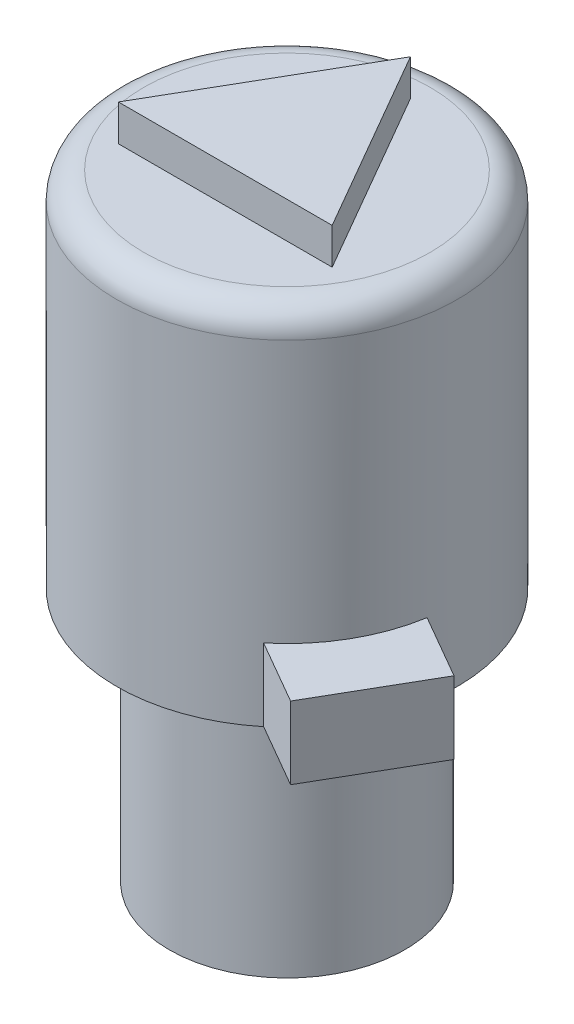
ISO-10303-21;
HEADER;
FILE_DESCRIPTION(('STEP AP214'),'2;1');
FILE_NAME('part.step','',(''),(''),'','','');
FILE_SCHEMA(('AUTOMOTIVE_DESIGN { 1 0 10303 214 1 1 1 1 }'));
ENDSEC;
DATA;
#1=APPLICATION_CONTEXT('core data for automotive mechanical design processes');
#2=APPLICATION_PROTOCOL_DEFINITION('international standard','automotive_design',2000,#1);
#3=PRODUCT_CONTEXT('',#1,'mechanical');
#4=PRODUCT('Part','Part','',(#3));
#5=PRODUCT_RELATED_PRODUCT_CATEGORY('part','',(#4));
#6=PRODUCT_DEFINITION_FORMATION('','',#4);
#7=PRODUCT_DEFINITION_CONTEXT('part definition',#1,'design');
#8=PRODUCT_DEFINITION('design','',#6,#7);
#9=PRODUCT_DEFINITION_SHAPE('','',#8);
#10=(LENGTH_UNIT() NAMED_UNIT(*) SI_UNIT(.MILLI.,.METRE.));
#11=(NAMED_UNIT(*) PLANE_ANGLE_UNIT() SI_UNIT($,.RADIAN.));
#12=(NAMED_UNIT(*) SI_UNIT($,.STERADIAN.) SOLID_ANGLE_UNIT());
#13=UNCERTAINTY_MEASURE_WITH_UNIT(LENGTH_MEASURE(1.E-05),#10,'distance_accuracy_value','');
#14=(GEOMETRIC_REPRESENTATION_CONTEXT(3) GLOBAL_UNCERTAINTY_ASSIGNED_CONTEXT((#13)) GLOBAL_UNIT_ASSIGNED_CONTEXT((#10,
#11,#12)) REPRESENTATION_CONTEXT('',''));
#15=CARTESIAN_POINT('',(0.,0.,0.));
#16=DIRECTION('',(0.,0.,1.));
#17=DIRECTION('',(1.,0.,0.));
#18=AXIS2_PLACEMENT_3D('',#15,#16,#17);
#19=CARTESIAN_POINT('',(0.,7.018,0.));
#20=DIRECTION('',(0.,-1.,0.));
#21=DIRECTION('',(0.,0.,-1.));
#22=AXIS2_PLACEMENT_3D('',#19,#20,#21);
#23=CYLINDRICAL_SURFACE('',#22,3.25);
#24=CARTESIAN_POINT('',(0.,7.018,0.));
#25=DIRECTION('',(0.,1.,0.));
#26=DIRECTION('',(0.,0.,1.));
#27=AXIS2_PLACEMENT_3D('',#24,#25,#26);
#28=CIRCLE('',#27,3.25);
#29=CARTESIAN_POINT('',(0.,7.018,3.25));
#30=VERTEX_POINT('',#29);
#31=EDGE_CURVE('E271',#30,#30,#28,.T.);
#32=ORIENTED_EDGE('',*,*,#31,.F.);
#33=EDGE_LOOP('',(#32));
#34=FACE_BOUND('',#33,.T.);
#35=CARTESIAN_POINT('',(0.,0.,0.));
#36=DIRECTION('',(0.,1.,0.));
#37=DIRECTION('',(0.,0.,1.));
#38=AXIS2_PLACEMENT_3D('',#35,#36,#37);
#39=CIRCLE('',#38,3.25);
#40=CARTESIAN_POINT('',(0.,0.,3.25));
#41=VERTEX_POINT('',#40);
#42=EDGE_CURVE('E275',#41,#41,#39,.T.);
#43=ORIENTED_EDGE('',*,*,#42,.T.);
#44=EDGE_LOOP('',(#43));
#45=FACE_BOUND('',#44,.T.);
#46=ADVANCED_FACE('F63',(#34,#45),#23,.T.);
#47=CARTESIAN_POINT('',(0.,0.,0.));
#48=DIRECTION('',(0.,1.,0.));
#49=DIRECTION('',(0.,0.,1.));
#50=AXIS2_PLACEMENT_3D('',#47,#48,#49);
#51=PLANE('',#50);
#52=ORIENTED_EDGE('',*,*,#42,.F.);
#53=EDGE_LOOP('',(#52));
#54=FACE_BOUND('',#53,.T.);
#55=ADVANCED_FACE('F303',(#54),#51,.F.);
#56=CARTESIAN_POINT('',(0.,17.018,0.));
#57=DIRECTION('',(0.,-1.,0.));
#58=DIRECTION('',(0.,0.,-1.));
#59=AXIS2_PLACEMENT_3D('',#56,#57,#58);
#60=CYLINDRICAL_SURFACE('',#59,4.7);
#61=CARTESIAN_POINT('',(0.,7.018,0.));
#62=DIRECTION('',(0.,1.,0.));
#63=DIRECTION('',(0.,0.,1.));
#64=AXIS2_PLACEMENT_3D('',#61,#62,#63);
#65=CIRCLE('',#64,4.7);
#66=CARTESIAN_POINT('',(4.63642498614182,7.018,0.770430624962345));
#67=VERTEX_POINT('',#66);
#68=CARTESIAN_POINT('',(-3.46607951606406,7.018,-3.17431768862556));
#69=VERTEX_POINT('',#68);
#70=EDGE_CURVE('E270',#67,#69,#65,.T.);
#71=ORIENTED_EDGE('',*,*,#70,.T.);
#72=DIRECTION('',(0.,-1.,0.));
#73=VECTOR('',#72,1.);
#74=CARTESIAN_POINT('',(-3.46607951606406,9.018,-3.17431768862556));
#75=LINE('',#74,#73);
#76=CARTESIAN_POINT('',(-3.46607951606406,9.018,-3.17431768862556));
#77=VERTEX_POINT('',#76);
#78=EDGE_CURVE('E79',#77,#69,#75,.T.);
#79=ORIENTED_EDGE('',*,*,#78,.F.);
#80=CARTESIAN_POINT('',(0.,9.018,0.));
#81=DIRECTION('',(0.,1.,0.));
#82=DIRECTION('',(0.,0.,-1.));
#83=AXIS2_PLACEMENT_3D('',#80,#81,#82);
#84=CIRCLE('',#83,4.7);
#85=CARTESIAN_POINT('',(-4.48207951606406,9.018,-1.41455406813558));
#86=VERTEX_POINT('',#85);
#87=EDGE_CURVE('E83',#77,#86,#84,.T.);
#88=ORIENTED_EDGE('',*,*,#87,.T.);
#89=DIRECTION('',(0.,-1.,0.));
#90=VECTOR('',#89,1.);
#91=CARTESIAN_POINT('',(-4.48207951606406,9.018,-1.41455406813558));
#92=LINE('',#91,#90);
#93=CARTESIAN_POINT('',(-4.48207951606406,7.018,-1.41455406813558));
#94=VERTEX_POINT('',#93);
#95=EDGE_CURVE('E159',#86,#94,#92,.T.);
#96=ORIENTED_EDGE('',*,*,#95,.T.);
#97=CARTESIAN_POINT('',(2.98542498614181,7.018,3.63004650825856));
#98=VERTEX_POINT('',#97);
#99=EDGE_CURVE('E267',#94,#98,#65,.T.);
#100=ORIENTED_EDGE('',*,*,#99,.T.);
#101=DIRECTION('',(0.,-1.,0.));
#102=VECTOR('',#101,1.);
#103=CARTESIAN_POINT('',(2.98542498614181,9.018,3.63004650825856));
#104=LINE('',#103,#102);
#105=CARTESIAN_POINT('',(2.98542498614181,9.018,3.63004650825856));
#106=VERTEX_POINT('',#105);
#107=EDGE_CURVE('E205',#106,#98,#104,.T.);
#108=ORIENTED_EDGE('',*,*,#107,.F.);
#109=CARTESIAN_POINT('',(0.,9.018,0.));
#110=DIRECTION('',(0.,1.,0.));
#111=DIRECTION('',(0.,0.,-1.));
#112=AXIS2_PLACEMENT_3D('',#109,#110,#111);
#113=CIRCLE('',#112,4.7);
#114=CARTESIAN_POINT('',(4.63642498614181,9.018,0.770430624962345));
#115=VERTEX_POINT('',#114);
#116=EDGE_CURVE('E214',#106,#115,#113,.T.);
#117=ORIENTED_EDGE('',*,*,#116,.T.);
#118=DIRECTION('',(0.,-1.,0.));
#119=VECTOR('',#118,1.);
#120=CARTESIAN_POINT('',(4.63642498614182,9.018,0.770430624962345));
#121=LINE('',#120,#119);
#122=EDGE_CURVE('E194',#115,#67,#121,.T.);
#123=ORIENTED_EDGE('',*,*,#122,.T.);
#124=EDGE_LOOP('',(#71,#79,#88,#96,#100,#108,#117,#123));
#125=FACE_BOUND('',#124,.T.);
#126=CARTESIAN_POINT('',(0.,16.268,0.));
#127=DIRECTION('',(0.,1.,0.));
#128=DIRECTION('',(0.,0.,1.));
#129=AXIS2_PLACEMENT_3D('',#126,#127,#128);
#130=CIRCLE('',#129,4.7);
#131=CARTESIAN_POINT('',(0.,16.268,4.7));
#132=VERTEX_POINT('',#131);
#133=EDGE_CURVE('E12',#132,#132,#130,.F.);
#134=ORIENTED_EDGE('',*,*,#133,.T.);
#135=EDGE_LOOP('',(#134));
#136=FACE_BOUND('',#135,.T.);
#137=ADVANCED_FACE('F308',(#125,#136),#60,.T.);
#138=CARTESIAN_POINT('',(0.,17.018,0.));
#139=DIRECTION('',(0.,1.,0.));
#140=DIRECTION('',(0.,0.,1.));
#141=AXIS2_PLACEMENT_3D('',#138,#139,#140);
#142=PLANE('',#141);
#143=CARTESIAN_POINT('',(0.,17.018,0.));
#144=DIRECTION('',(0.,1.,0.));
#145=DIRECTION('',(0.,0.,1.));
#146=AXIS2_PLACEMENT_3D('',#143,#144,#145);
#147=CIRCLE('',#146,3.95);
#148=CARTESIAN_POINT('',(0.,17.018,3.95));
#149=VERTEX_POINT('',#148);
#150=EDGE_CURVE('E72',#149,#149,#147,.T.);
#151=ORIENTED_EDGE('',*,*,#150,.T.);
#152=EDGE_LOOP('',(#151));
#153=FACE_BOUND('',#152,.T.);
#154=DIRECTION('',(1.,0.,0.));
#155=VECTOR('',#154,1.);
#156=CARTESIAN_POINT('',(-2.95,17.018,1.7031832941094));
#157=LINE('',#156,#155);
#158=CARTESIAN_POINT('',(-2.95,17.018,1.7031832941094));
#159=VERTEX_POINT('',#158);
#160=CARTESIAN_POINT('',(2.95,17.018,1.7031832941094));
#161=VERTEX_POINT('',#160);
#162=EDGE_CURVE('E189',#159,#161,#157,.T.);
#163=ORIENTED_EDGE('',*,*,#162,.F.);
#164=DIRECTION('',(-0.500000000000001,0.,0.866025403784438));
#165=VECTOR('',#164,1.);
#166=CARTESIAN_POINT('',(0.,17.018,-3.40636658821879));
#167=LINE('',#166,#165);
#168=CARTESIAN_POINT('',(0.,17.018,-3.40636658821879));
#169=VERTEX_POINT('',#168);
#170=EDGE_CURVE('E239',#169,#159,#167,.T.);
#171=ORIENTED_EDGE('',*,*,#170,.F.);
#172=DIRECTION('',(-0.499999999999999,0.,-0.866025403784439));
#173=VECTOR('',#172,1.);
#174=CARTESIAN_POINT('',(2.95,17.018,1.7031832941094));
#175=LINE('',#174,#173);
#176=EDGE_CURVE('E249',#161,#169,#175,.T.);
#177=ORIENTED_EDGE('',*,*,#176,.F.);
#178=EDGE_LOOP('',(#163,#171,#177));
#179=FACE_BOUND('',#178,.T.);
#180=ADVANCED_FACE('F282',(#153,#179),#142,.T.);
#181=CARTESIAN_POINT('',(0.,7.018,0.));
#182=DIRECTION('',(0.,1.,0.));
#183=DIRECTION('',(0.,0.,1.));
#184=AXIS2_PLACEMENT_3D('',#181,#182,#183);
#185=PLANE('',#184);
#186=ORIENTED_EDGE('',*,*,#31,.T.);
#187=EDGE_LOOP('',(#186));
#188=FACE_BOUND('',#187,.T.);
#189=ORIENTED_EDGE('',*,*,#70,.F.);
#190=DIRECTION('',(0.866025403784438,0.,0.500000000000002));
#191=VECTOR('',#190,1.);
#192=CARTESIAN_POINT('',(6.39618860663179,7.018,1.78643062496235));
#193=LINE('',#192,#191);
#194=CARTESIAN_POINT('',(6.39618860663179,7.018,1.78643062496235));
#195=VERTEX_POINT('',#194);
#196=EDGE_CURVE('E181',#67,#195,#193,.T.);
#197=ORIENTED_EDGE('',*,*,#196,.T.);
#198=DIRECTION('',(-0.500000000000002,0.,0.866025403784438));
#199=VECTOR('',#198,1.);
#200=CARTESIAN_POINT('',(4.74518860663179,7.018,4.64604650825856));
#201=LINE('',#200,#199);
#202=CARTESIAN_POINT('',(4.74518860663179,7.018,4.64604650825856));
#203=VERTEX_POINT('',#202);
#204=EDGE_CURVE('E213',#195,#203,#201,.T.);
#205=ORIENTED_EDGE('',*,*,#204,.T.);
#206=DIRECTION('',(-0.866025403784438,0.,-0.500000000000001));
#207=VECTOR('',#206,1.);
#208=CARTESIAN_POINT('',(2.98542498614181,7.018,3.63004650825856));
#209=LINE('',#208,#207);
#210=EDGE_CURVE('E209',#203,#98,#209,.T.);
#211=ORIENTED_EDGE('',*,*,#210,.T.);
#212=ORIENTED_EDGE('',*,*,#99,.F.);
#213=DIRECTION('',(-0.866025403784437,0.,-0.500000000000002));
#214=VECTOR('',#213,1.);
#215=CARTESIAN_POINT('',(-4.48207951606406,7.018,-1.41455406813558));
#216=LINE('',#215,#214);
#217=CARTESIAN_POINT('',(-6.24184313655404,7.018,-2.43055406813559));
#218=VERTEX_POINT('',#217);
#219=EDGE_CURVE('E178',#94,#218,#216,.T.);
#220=ORIENTED_EDGE('',*,*,#219,.T.);
#221=DIRECTION('',(0.500000000000001,0.,-0.866025403784438));
#222=VECTOR('',#221,1.);
#223=CARTESIAN_POINT('',(-6.24184313655404,7.018,-2.43055406813559));
#224=LINE('',#223,#222);
#225=CARTESIAN_POINT('',(-5.22584313655404,7.018,-4.19031768862556));
#226=VERTEX_POINT('',#225);
#227=EDGE_CURVE('E152',#218,#226,#224,.T.);
#228=ORIENTED_EDGE('',*,*,#227,.T.);
#229=DIRECTION('',(0.866025403784438,0.,0.500000000000001));
#230=VECTOR('',#229,1.);
#231=CARTESIAN_POINT('',(-5.22584313655404,7.018,-4.19031768862556));
#232=LINE('',#231,#230);
#233=EDGE_CURVE('E173',#226,#69,#232,.T.);
#234=ORIENTED_EDGE('',*,*,#233,.T.);
#235=EDGE_LOOP('',(#189,#197,#205,#211,#212,#220,#228,#234));
#236=FACE_BOUND('',#235,.T.);
#237=ADVANCED_FACE('F315',(#188,#236),#185,.F.);
#238=CARTESIAN_POINT('',(-2.95,18.018,1.7031832941094));
#239=DIRECTION('',(0.,0.,-1.));
#240=DIRECTION('',(-1.,0.,0.));
#241=AXIS2_PLACEMENT_3D('',#238,#239,#240);
#242=PLANE('',#241);
#243=ORIENTED_EDGE('',*,*,#162,.T.);
#244=DIRECTION('',(0.,-1.,0.));
#245=VECTOR('',#244,1.);
#246=CARTESIAN_POINT('',(2.95,18.018,1.7031832941094));
#247=LINE('',#246,#245);
#248=CARTESIAN_POINT('',(2.95,18.018,1.7031832941094));
#249=VERTEX_POINT('',#248);
#250=EDGE_CURVE('E263',#249,#161,#247,.T.);
#251=ORIENTED_EDGE('',*,*,#250,.F.);
#252=DIRECTION('',(1.,0.,0.));
#253=VECTOR('',#252,1.);
#254=CARTESIAN_POINT('',(-2.95,18.018,1.7031832941094));
#255=LINE('',#254,#253);
#256=CARTESIAN_POINT('',(-2.95,18.018,1.7031832941094));
#257=VERTEX_POINT('',#256);
#258=EDGE_CURVE('E234',#257,#249,#255,.T.);
#259=ORIENTED_EDGE('',*,*,#258,.F.);
#260=DIRECTION('',(0.,-1.,0.));
#261=VECTOR('',#260,1.);
#262=CARTESIAN_POINT('',(-2.95,18.018,1.7031832941094));
#263=LINE('',#262,#261);
#264=EDGE_CURVE('E245',#257,#159,#263,.T.);
#265=ORIENTED_EDGE('',*,*,#264,.T.);
#266=EDGE_LOOP('',(#243,#251,#259,#265));
#267=FACE_BOUND('',#266,.T.);
#268=ADVANCED_FACE('F318',(#267),#242,.F.);
#269=CARTESIAN_POINT('',(2.95,18.018,1.7031832941094));
#270=DIRECTION('',(-0.866025403784439,0.,0.5));
#271=DIRECTION('',(0.5,0.,0.866025403784439));
#272=AXIS2_PLACEMENT_3D('',#269,#270,#271);
#273=PLANE('',#272);
#274=ORIENTED_EDGE('',*,*,#176,.T.);
#275=DIRECTION('',(0.,-1.,0.));
#276=VECTOR('',#275,1.);
#277=CARTESIAN_POINT('',(0.,18.018,-3.40636658821879));
#278=LINE('',#277,#276);
#279=CARTESIAN_POINT('',(0.,18.018,-3.40636658821879));
#280=VERTEX_POINT('',#279);
#281=EDGE_CURVE('E259',#280,#169,#278,.T.);
#282=ORIENTED_EDGE('',*,*,#281,.F.);
#283=DIRECTION('',(-0.499999999999999,0.,-0.866025403784439));
#284=VECTOR('',#283,1.);
#285=CARTESIAN_POINT('',(2.95,18.018,1.7031832941094));
#286=LINE('',#285,#284);
#287=EDGE_CURVE('E238',#249,#280,#286,.T.);
#288=ORIENTED_EDGE('',*,*,#287,.F.);
#289=ORIENTED_EDGE('',*,*,#250,.T.);
#290=EDGE_LOOP('',(#274,#282,#288,#289));
#291=FACE_BOUND('',#290,.T.);
#292=ADVANCED_FACE('F323',(#291),#273,.F.);
#293=CARTESIAN_POINT('',(0.,18.018,-3.40636658821879));
#294=DIRECTION('',(0.866025403784438,0.,0.500000000000001));
#295=DIRECTION('',(0.500000000000001,0.,-0.866025403784438));
#296=AXIS2_PLACEMENT_3D('',#293,#294,#295);
#297=PLANE('',#296);
#298=ORIENTED_EDGE('',*,*,#170,.T.);
#299=ORIENTED_EDGE('',*,*,#264,.F.);
#300=DIRECTION('',(-0.500000000000001,0.,0.866025403784438));
#301=VECTOR('',#300,1.);
#302=CARTESIAN_POINT('',(0.,18.018,-3.40636658821879));
#303=LINE('',#302,#301);
#304=EDGE_CURVE('E242',#280,#257,#303,.T.);
#305=ORIENTED_EDGE('',*,*,#304,.F.);
#306=ORIENTED_EDGE('',*,*,#281,.T.);
#307=EDGE_LOOP('',(#298,#299,#305,#306));
#308=FACE_BOUND('',#307,.T.);
#309=ADVANCED_FACE('F298',(#308),#297,.F.);
#310=CARTESIAN_POINT('',(0.,18.018,0.));
#311=DIRECTION('',(0.,1.,0.));
#312=DIRECTION('',(0.,0.,1.));
#313=AXIS2_PLACEMENT_3D('',#310,#311,#312);
#314=PLANE('',#313);
#315=ORIENTED_EDGE('',*,*,#258,.T.);
#316=ORIENTED_EDGE('',*,*,#287,.T.);
#317=ORIENTED_EDGE('',*,*,#304,.T.);
#318=EDGE_LOOP('',(#315,#316,#317));
#319=FACE_BOUND('',#318,.T.);
#320=ADVANCED_FACE('F287',(#319),#314,.T.);
#321=CARTESIAN_POINT('',(0.,16.268,0.));
#322=DIRECTION('',(0.,1.,0.));
#323=DIRECTION('',(0.,0.,1.));
#324=AXIS2_PLACEMENT_3D('',#321,#322,#323);
#325=TOROIDAL_SURFACE('',#324,3.95,0.75);
#326=ORIENTED_EDGE('',*,*,#133,.F.);
#327=EDGE_LOOP('',(#326));
#328=FACE_BOUND('',#327,.T.);
#329=ORIENTED_EDGE('',*,*,#150,.F.);
#330=EDGE_LOOP('',(#329));
#331=FACE_BOUND('',#330,.T.);
#332=ADVANCED_FACE('F65',(#328,#331),#325,.T.);
#333=CARTESIAN_POINT('',(2.98542498614181,9.018,3.63004650825856));
#334=DIRECTION('',(-0.500000000000001,0.,0.866025403784438));
#335=DIRECTION('',(0.866025403784438,0.,0.500000000000001));
#336=AXIS2_PLACEMENT_3D('',#333,#334,#335);
#337=PLANE('',#336);
#338=ORIENTED_EDGE('',*,*,#210,.F.);
#339=DIRECTION('',(0.,-1.,0.));
#340=VECTOR('',#339,1.);
#341=CARTESIAN_POINT('',(4.74518860663179,9.018,4.64604650825856));
#342=LINE('',#341,#340);
#343=CARTESIAN_POINT('',(4.74518860663179,9.018,4.64604650825856));
#344=VERTEX_POINT('',#343);
#345=EDGE_CURVE('E202',#344,#203,#342,.T.);
#346=ORIENTED_EDGE('',*,*,#345,.F.);
#347=DIRECTION('',(-0.866025403784438,0.,-0.500000000000001));
#348=VECTOR('',#347,1.);
#349=CARTESIAN_POINT('',(2.98542498614181,9.018,3.63004650825856));
#350=LINE('',#349,#348);
#351=EDGE_CURVE('E198',#344,#106,#350,.T.);
#352=ORIENTED_EDGE('',*,*,#351,.T.);
#353=ORIENTED_EDGE('',*,*,#107,.T.);
#354=EDGE_LOOP('',(#338,#346,#352,#353));
#355=FACE_BOUND('',#354,.T.);
#356=ADVANCED_FACE('F286',(#355),#337,.T.);
#357=CARTESIAN_POINT('',(4.74518860663179,9.018,4.64604650825856));
#358=DIRECTION('',(0.866025403784438,0.,0.500000000000002));
#359=DIRECTION('',(0.500000000000002,0.,-0.866025403784438));
#360=AXIS2_PLACEMENT_3D('',#357,#358,#359);
#361=PLANE('',#360);
#362=ORIENTED_EDGE('',*,*,#204,.F.);
#363=DIRECTION('',(0.,-1.,0.));
#364=VECTOR('',#363,1.);
#365=CARTESIAN_POINT('',(6.39618860663179,9.018,1.78643062496235));
#366=LINE('',#365,#364);
#367=CARTESIAN_POINT('',(6.39618860663179,9.018,1.78643062496235));
#368=VERTEX_POINT('',#367);
#369=EDGE_CURVE('E199',#368,#195,#366,.T.);
#370=ORIENTED_EDGE('',*,*,#369,.F.);
#371=DIRECTION('',(-0.500000000000002,0.,0.866025403784438));
#372=VECTOR('',#371,1.);
#373=CARTESIAN_POINT('',(4.74518860663179,9.018,4.64604650825856));
#374=LINE('',#373,#372);
#375=EDGE_CURVE('E224',#368,#344,#374,.T.);
#376=ORIENTED_EDGE('',*,*,#375,.T.);
#377=ORIENTED_EDGE('',*,*,#345,.T.);
#378=EDGE_LOOP('',(#362,#370,#376,#377));
#379=FACE_BOUND('',#378,.T.);
#380=ADVANCED_FACE('F294',(#379),#361,.T.);
#381=CARTESIAN_POINT('',(6.39618860663179,9.018,1.78643062496235));
#382=DIRECTION('',(0.500000000000002,0.,-0.866025403784438));
#383=DIRECTION('',(-0.866025403784438,0.,-0.500000000000002));
#384=AXIS2_PLACEMENT_3D('',#381,#382,#383);
#385=PLANE('',#384);
#386=ORIENTED_EDGE('',*,*,#196,.F.);
#387=ORIENTED_EDGE('',*,*,#122,.F.);
#388=DIRECTION('',(0.866025403784438,0.,0.500000000000002));
#389=VECTOR('',#388,1.);
#390=CARTESIAN_POINT('',(6.39618860663179,9.018,1.78643062496235));
#391=LINE('',#390,#389);
#392=EDGE_CURVE('E228',#115,#368,#391,.T.);
#393=ORIENTED_EDGE('',*,*,#392,.T.);
#394=ORIENTED_EDGE('',*,*,#369,.T.);
#395=EDGE_LOOP('',(#386,#387,#393,#394));
#396=FACE_BOUND('',#395,.T.);
#397=ADVANCED_FACE('F334',(#396),#385,.T.);
#398=CARTESIAN_POINT('',(0.,9.018,0.));
#399=DIRECTION('',(0.,-1.,0.));
#400=DIRECTION('',(0.,0.,-1.));
#401=AXIS2_PLACEMENT_3D('',#398,#399,#400);
#402=PLANE('',#401);
#403=ORIENTED_EDGE('',*,*,#116,.F.);
#404=ORIENTED_EDGE('',*,*,#351,.F.);
#405=ORIENTED_EDGE('',*,*,#375,.F.);
#406=ORIENTED_EDGE('',*,*,#392,.F.);
#407=EDGE_LOOP('',(#403,#404,#405,#406));
#408=FACE_BOUND('',#407,.T.);
#409=ADVANCED_FACE('F331',(#408),#402,.F.);
#410=CARTESIAN_POINT('',(-5.22584313655404,9.018,-4.19031768862556));
#411=DIRECTION('',(0.500000000000001,0.,-0.866025403784438));
#412=DIRECTION('',(-0.866025403784438,0.,-0.500000000000001));
#413=AXIS2_PLACEMENT_3D('',#410,#411,#412);
#414=PLANE('',#413);
#415=ORIENTED_EDGE('',*,*,#233,.F.);
#416=DIRECTION('',(0.,-1.,0.));
#417=VECTOR('',#416,1.);
#418=CARTESIAN_POINT('',(-5.22584313655404,9.018,-4.19031768862556));
#419=LINE('',#418,#417);
#420=CARTESIAN_POINT('',(-5.22584313655404,9.018,-4.19031768862556));
#421=VERTEX_POINT('',#420);
#422=EDGE_CURVE('E158',#421,#226,#419,.T.);
#423=ORIENTED_EDGE('',*,*,#422,.F.);
#424=DIRECTION('',(0.866025403784438,0.,0.500000000000001));
#425=VECTOR('',#424,1.);
#426=CARTESIAN_POINT('',(-5.22584313655404,9.018,-4.19031768862556));
#427=LINE('',#426,#425);
#428=EDGE_CURVE('E166',#421,#77,#427,.T.);
#429=ORIENTED_EDGE('',*,*,#428,.T.);
#430=ORIENTED_EDGE('',*,*,#78,.T.);
#431=EDGE_LOOP('',(#415,#423,#429,#430));
#432=FACE_BOUND('',#431,.T.);
#433=ADVANCED_FACE('F333',(#432),#414,.T.);
#434=CARTESIAN_POINT('',(-6.24184313655404,9.018,-2.43055406813559));
#435=DIRECTION('',(-0.866025403784438,0.,-0.500000000000001));
#436=DIRECTION('',(-0.500000000000001,0.,0.866025403784438));
#437=AXIS2_PLACEMENT_3D('',#434,#435,#436);
#438=PLANE('',#437);
#439=ORIENTED_EDGE('',*,*,#227,.F.);
#440=DIRECTION('',(0.,-1.,0.));
#441=VECTOR('',#440,1.);
#442=CARTESIAN_POINT('',(-6.24184313655404,9.018,-2.43055406813559));
#443=LINE('',#442,#441);
#444=CARTESIAN_POINT('',(-6.24184313655404,9.018,-2.43055406813559));
#445=VERTEX_POINT('',#444);
#446=EDGE_CURVE('E146',#445,#218,#443,.T.);
#447=ORIENTED_EDGE('',*,*,#446,.F.);
#448=DIRECTION('',(0.500000000000001,0.,-0.866025403784438));
#449=VECTOR('',#448,1.);
#450=CARTESIAN_POINT('',(-6.24184313655404,9.018,-2.43055406813559));
#451=LINE('',#450,#449);
#452=EDGE_CURVE('E149',#445,#421,#451,.T.);
#453=ORIENTED_EDGE('',*,*,#452,.T.);
#454=ORIENTED_EDGE('',*,*,#422,.T.);
#455=EDGE_LOOP('',(#439,#447,#453,#454));
#456=FACE_BOUND('',#455,.T.);
#457=ADVANCED_FACE('F148',(#456),#438,.T.);
#458=CARTESIAN_POINT('',(-4.48207951606406,9.018,-1.41455406813558));
#459=DIRECTION('',(-0.500000000000002,0.,0.866025403784437));
#460=DIRECTION('',(0.866025403784437,0.,0.500000000000002));
#461=AXIS2_PLACEMENT_3D('',#458,#459,#460);
#462=PLANE('',#461);
#463=ORIENTED_EDGE('',*,*,#219,.F.);
#464=ORIENTED_EDGE('',*,*,#95,.F.);
#465=DIRECTION('',(-0.866025403784437,0.,-0.500000000000002));
#466=VECTOR('',#465,1.);
#467=CARTESIAN_POINT('',(-4.48207951606406,9.018,-1.41455406813558));
#468=LINE('',#467,#466);
#469=EDGE_CURVE('E164',#86,#445,#468,.T.);
#470=ORIENTED_EDGE('',*,*,#469,.T.);
#471=ORIENTED_EDGE('',*,*,#446,.T.);
#472=EDGE_LOOP('',(#463,#464,#470,#471));
#473=FACE_BOUND('',#472,.T.);
#474=ADVANCED_FACE('F169',(#473),#462,.T.);
#475=CARTESIAN_POINT('',(0.,9.018,0.));
#476=DIRECTION('',(0.,-1.,0.));
#477=DIRECTION('',(0.,0.,-1.));
#478=AXIS2_PLACEMENT_3D('',#475,#476,#477);
#479=PLANE('',#478);
#480=ORIENTED_EDGE('',*,*,#87,.F.);
#481=ORIENTED_EDGE('',*,*,#428,.F.);
#482=ORIENTED_EDGE('',*,*,#452,.F.);
#483=ORIENTED_EDGE('',*,*,#469,.F.);
#484=EDGE_LOOP('',(#480,#481,#482,#483));
#485=FACE_BOUND('',#484,.T.);
#486=ADVANCED_FACE('F163',(#485),#479,.F.);
#487=CLOSED_SHELL('',(#46,#55,#137,#180,#237,#268,#292,#309,#320,#332,#356,#380,#397,#409,#433,
#457,#474,#486));
#488=MANIFOLD_SOLID_BREP('B2',#487);
#489=ADVANCED_BREP_SHAPE_REPRESENTATION('',(#18,#488),#14);
#490=SHAPE_DEFINITION_REPRESENTATION(#9,#489);
ENDSEC;
END-ISO-10303-21;
